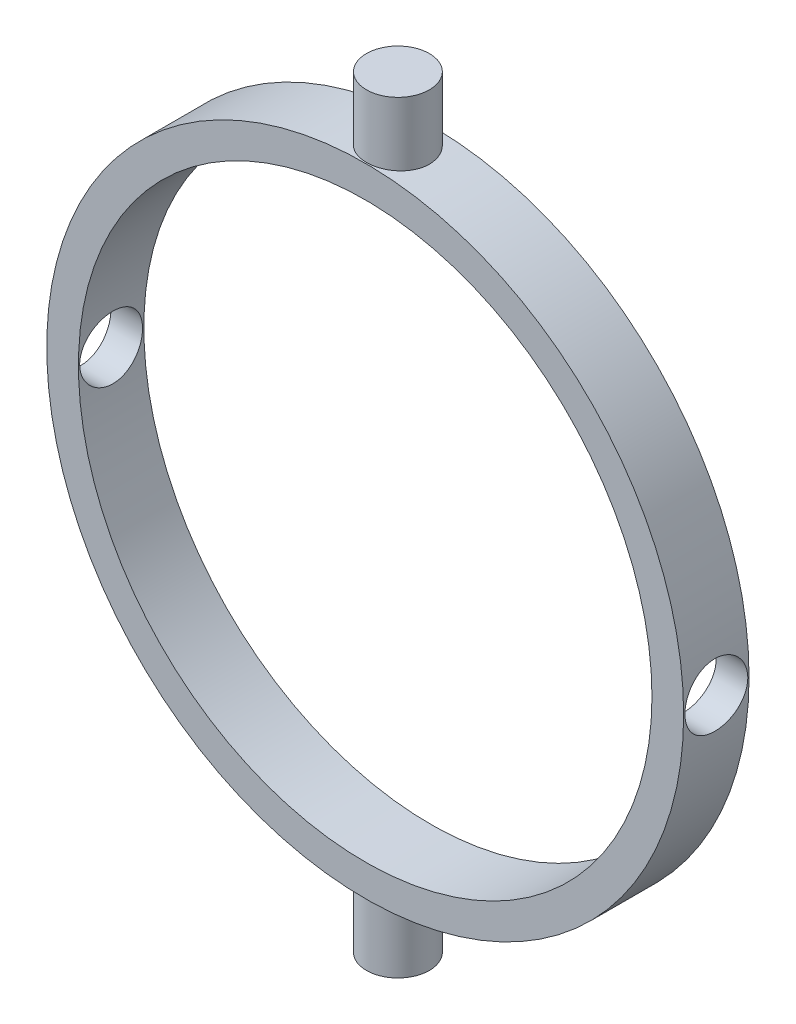
ISO-10303-21;
HEADER;
FILE_DESCRIPTION(('STEP AP214'),'2;1');
FILE_NAME('part.step','',(''),(''),'','','');
FILE_SCHEMA(('AUTOMOTIVE_DESIGN { 1 0 10303 214 1 1 1 1 }'));
ENDSEC;
DATA;
#1=APPLICATION_CONTEXT('core data for automotive mechanical design processes');
#2=APPLICATION_PROTOCOL_DEFINITION('international standard','automotive_design',2000,#1);
#3=PRODUCT_CONTEXT('',#1,'mechanical');
#4=PRODUCT('Part','Part','',(#3));
#5=PRODUCT_RELATED_PRODUCT_CATEGORY('part','',(#4));
#6=PRODUCT_DEFINITION_FORMATION('','',#4);
#7=PRODUCT_DEFINITION_CONTEXT('part definition',#1,'design');
#8=PRODUCT_DEFINITION('design','',#6,#7);
#9=PRODUCT_DEFINITION_SHAPE('','',#8);
#10=(LENGTH_UNIT() NAMED_UNIT(*) SI_UNIT(.MILLI.,.METRE.));
#11=(NAMED_UNIT(*) PLANE_ANGLE_UNIT() SI_UNIT($,.RADIAN.));
#12=(NAMED_UNIT(*) SI_UNIT($,.STERADIAN.) SOLID_ANGLE_UNIT());
#13=UNCERTAINTY_MEASURE_WITH_UNIT(LENGTH_MEASURE(1.E-05),#10,'distance_accuracy_value','');
#14=(GEOMETRIC_REPRESENTATION_CONTEXT(3) GLOBAL_UNCERTAINTY_ASSIGNED_CONTEXT((#13)) GLOBAL_UNIT_ASSIGNED_CONTEXT((#10,
#11,#12)) REPRESENTATION_CONTEXT('',''));
#15=CARTESIAN_POINT('',(0.,0.,0.));
#16=DIRECTION('',(0.,0.,1.));
#17=DIRECTION('',(1.,0.,0.));
#18=AXIS2_PLACEMENT_3D('',#15,#16,#17);
#19=CARTESIAN_POINT('',(0.,0.,3.302));
#20=DIRECTION('',(0.,0.,1.));
#21=DIRECTION('',(1.,0.,0.));
#22=AXIS2_PLACEMENT_3D('',#19,#20,#21);
#23=PLANE('',#22);
#24=CARTESIAN_POINT('',(0.,0.,3.302));
#25=DIRECTION('',(0.,0.,1.));
#26=DIRECTION('',(1.,0.,0.));
#27=AXIS2_PLACEMENT_3D('',#24,#25,#26);
#28=CIRCLE('',#27,16.078);
#29=CARTESIAN_POINT('',(16.078,0.,3.302));
#30=VERTEX_POINT('',#29);
#31=EDGE_CURVE('E10',#30,#30,#28,.T.);
#32=ORIENTED_EDGE('',*,*,#31,.T.);
#33=EDGE_LOOP('',(#32));
#34=FACE_BOUND('',#33,.T.);
#35=CARTESIAN_POINT('',(0.,0.,3.302));
#36=DIRECTION('',(0.,0.,1.));
#37=DIRECTION('',(1.,0.,0.));
#38=AXIS2_PLACEMENT_3D('',#35,#36,#37);
#39=CIRCLE('',#38,14.478);
#40=CARTESIAN_POINT('',(14.478,0.,3.302));
#41=VERTEX_POINT('',#40);
#42=EDGE_CURVE('E48',#41,#41,#39,.T.);
#43=ORIENTED_EDGE('',*,*,#42,.F.);
#44=EDGE_LOOP('',(#43));
#45=FACE_BOUND('',#44,.T.);
#46=ADVANCED_FACE('F31',(#34,#45),#23,.T.);
#47=CARTESIAN_POINT('',(0.,0.,0.));
#48=DIRECTION('',(0.,0.,1.));
#49=DIRECTION('',(1.,0.,0.));
#50=AXIS2_PLACEMENT_3D('',#47,#48,#49);
#51=PLANE('',#50);
#52=CARTESIAN_POINT('',(0.,0.,0.));
#53=DIRECTION('',(0.,0.,1.));
#54=DIRECTION('',(1.,0.,0.));
#55=AXIS2_PLACEMENT_3D('',#52,#53,#54);
#56=CIRCLE('',#55,16.078);
#57=CARTESIAN_POINT('',(16.078,0.,0.));
#58=VERTEX_POINT('',#57);
#59=EDGE_CURVE('E43',#58,#58,#56,.T.);
#60=ORIENTED_EDGE('',*,*,#59,.F.);
#61=EDGE_LOOP('',(#60));
#62=FACE_BOUND('',#61,.T.);
#63=CARTESIAN_POINT('',(0.,0.,0.));
#64=DIRECTION('',(0.,0.,1.));
#65=DIRECTION('',(1.,0.,0.));
#66=AXIS2_PLACEMENT_3D('',#63,#64,#65);
#67=CIRCLE('',#66,14.478);
#68=CARTESIAN_POINT('',(14.478,0.,0.));
#69=VERTEX_POINT('',#68);
#70=EDGE_CURVE('E51',#69,#69,#67,.T.);
#71=ORIENTED_EDGE('',*,*,#70,.T.);
#72=EDGE_LOOP('',(#71));
#73=FACE_BOUND('',#72,.T.);
#74=ADVANCED_FACE('F99',(#62,#73),#51,.F.);
#75=CARTESIAN_POINT('',(0.,0.,3.302));
#76=DIRECTION('',(0.,0.,-1.));
#77=DIRECTION('',(-1.,0.,0.));
#78=AXIS2_PLACEMENT_3D('',#75,#76,#77);
#79=CYLINDRICAL_SURFACE('',#78,16.078);
#80=CARTESIAN_POINT('',(0.,-16.078,0.0635000000000004));
#81=CARTESIAN_POINT('',(-0.0889382676750473,-16.0779989879593,0.0635038542711527));
#82=CARTESIAN_POINT('',(-0.177935479899864,-16.077254190012,0.070999191950062));
#83=CARTESIAN_POINT('',(-0.353462963078393,-16.0743546615422,0.100786642436206));
#84=CARTESIAN_POINT('',(-0.439990399665971,-16.0721983740973,0.123095095019822));
#85=CARTESIAN_POINT('',(-0.608011075362086,-16.066719294506,0.181853368071917));
#86=CARTESIAN_POINT('',(-0.689507305127902,-16.0633972033442,0.218294691985423));
#87=CARTESIAN_POINT('',(-0.845208502832662,-16.0559580732716,0.30426788499456));
#88=CARTESIAN_POINT('',(-0.919414925570739,-16.051841193462,0.353797134872641));
#89=CARTESIAN_POINT('',(-1.05870864188994,-16.0432575484305,0.464727029545062));
#90=CARTESIAN_POINT('',(-1.12376674041012,-16.0387897309302,0.526164256320707));
#91=CARTESIAN_POINT('',(-1.24266615527061,-16.0300164732231,0.659088155922096));
#92=CARTESIAN_POINT('',(-1.29650695498905,-16.0257110405024,0.730575291350765));
#93=CARTESIAN_POINT('',(-1.3915464631122,-16.0177392242088,0.881752002545344));
#94=CARTESIAN_POINT('',(-1.43271881326449,-16.014074179793,0.961458225493041));
#95=CARTESIAN_POINT('',(-1.50108437820784,-16.0078110683199,1.12669506518588));
#96=CARTESIAN_POINT('',(-1.52827793024595,-16.005212975522,1.21222554136097));
#97=CARTESIAN_POINT('',(-1.56782757151222,-16.0013873859481,1.38638565569388));
#98=CARTESIAN_POINT('',(-1.58023201433572,-16.0001554234819,1.47500421360364));
#99=CARTESIAN_POINT('',(-1.59000078289009,-15.9991876951945,1.65307335709822));
#100=CARTESIAN_POINT('',(-1.58736549463514,-15.9994518909724,1.7425239212697));
#101=CARTESIAN_POINT('',(-1.56716947066429,-16.0014425523564,1.91938474667379));
#102=CARTESIAN_POINT('',(-1.54966151054823,-16.0031638473778,2.00680110081273));
#103=CARTESIAN_POINT('',(-1.50029923682016,-16.0078666804143,2.17744854612422));
#104=CARTESIAN_POINT('',(-1.4684447337869,-16.0108482350688,2.26067958202075));
#105=CARTESIAN_POINT('',(-1.39123528411931,-16.0177415898581,2.42076060145031));
#106=CARTESIAN_POINT('',(-1.34585690114137,-16.0216550024795,2.49759920902935));
#107=CARTESIAN_POINT('',(-1.24290466275163,-16.0299697546477,2.64258972721676));
#108=CARTESIAN_POINT('',(-1.18533045940598,-16.0343711081132,2.71074138990692));
#109=CARTESIAN_POINT('',(-1.05932603440417,-16.043188855458,2.83673013479299));
#110=CARTESIAN_POINT('',(-0.990850230648413,-16.0476052327054,2.89452164018275));
#111=CARTESIAN_POINT('',(-0.845144722280787,-16.0559375396488,2.99779639681944));
#112=CARTESIAN_POINT('',(-0.767915008224165,-16.0598534688049,3.04327963478658));
#113=CARTESIAN_POINT('',(-0.606862530341768,-16.0667448994797,3.12064484352772));
#114=CARTESIAN_POINT('',(-0.523038660065916,-16.0697202427529,3.15252452593695));
#115=CARTESIAN_POINT('',(-0.351192104996481,-16.0743936285418,3.20174439561136));
#116=CARTESIAN_POINT('',(-0.263169542686512,-16.0760917082935,3.21908500673434));
#117=CARTESIAN_POINT('',(-0.0858189677551975,-16.078014455167,3.23867673307555));
#118=CARTESIAN_POINT('',(0.00350203282572145,-16.078245263841,3.24099074595732));
#119=CARTESIAN_POINT('',(0.181260596450081,-16.0772239252541,3.23062875341915));
#120=CARTESIAN_POINT('',(0.26969817110869,-16.0759717975166,3.2179529453457));
#121=CARTESIAN_POINT('',(0.442998104127631,-16.0721292355268,3.17802330697083));
#122=CARTESIAN_POINT('',(0.527867307381731,-16.0695415030083,3.15079890243897));
#123=CARTESIAN_POINT('',(0.691834079743259,-16.0633180729494,3.08257509728624));
#124=CARTESIAN_POINT('',(0.770931522483446,-16.059682352473,3.04157539517834));
#125=CARTESIAN_POINT('',(0.921394019751391,-16.0517544010219,2.94680866962908));
#126=CARTESIAN_POINT('',(0.992732915892643,-16.0474600600101,2.89300029349199));
#127=CARTESIAN_POINT('',(1.12538854300176,-16.0387035855597,2.77420297163953));
#128=CARTESIAN_POINT('',(1.18670502876311,-16.0342414480193,2.70921375245544));
#129=CARTESIAN_POINT('',(1.29779345703795,-16.0256338383346,2.56962523165333));
#130=CARTESIAN_POINT('',(1.34752413902179,-16.021489532188,2.49499301173576));
#131=CARTESIAN_POINT('',(1.43374570402312,-16.0140044404204,2.33839951148539));
#132=CARTESIAN_POINT('',(1.47023676415588,-16.0106636440505,2.25643832921529));
#133=CARTESIAN_POINT('',(1.52887406523071,-16.0051710352831,2.08765536016073));
#134=CARTESIAN_POINT('',(1.55104491423902,-16.0030171841614,2.00084219161777));
#135=CARTESIAN_POINT('',(1.58049231028194,-16.0001359515238,1.82470304183133));
#136=CARTESIAN_POINT('',(1.58776927281305,-15.9994085302147,1.7353771307566));
#137=CARTESIAN_POINT('',(1.58721664296104,-15.9994633317582,1.55715822918347));
#138=CARTESIAN_POINT('',(1.57945186671098,-16.0002390773407,1.46826502859551));
#139=CARTESIAN_POINT('',(1.54917201218494,-16.0031989979117,1.29305241721677));
#140=CARTESIAN_POINT('',(1.52665691677053,-16.0053831745367,1.20673300941661));
#141=CARTESIAN_POINT('',(1.46753331037538,-16.0109120653144,1.03911838186023));
#142=CARTESIAN_POINT('',(1.43092664256717,-16.0142566276835,0.95782250664102));
#143=CARTESIAN_POINT('',(1.34466574748404,-16.0217297454046,0.802518684060499));
#144=CARTESIAN_POINT('',(1.29501160400609,-16.0258582957214,0.728510689897217));
#145=CARTESIAN_POINT('',(1.18382180137763,-16.0344555038849,0.589551285554547));
#146=CARTESIAN_POINT('',(1.12223786153087,-16.0389254974754,0.524638589440587));
#147=CARTESIAN_POINT('',(0.989031649090707,-16.0476897345662,0.406039826833557));
#148=CARTESIAN_POINT('',(0.917406973596753,-16.0519839356779,0.352356455375063));
#149=CARTESIAN_POINT('',(0.765960199905421,-16.0599236839797,0.257636854017595));
#150=CARTESIAN_POINT('',(0.68611834471779,-16.063567607379,0.216632101732114));
#151=CARTESIAN_POINT('',(0.520697890948837,-16.0697784779415,0.148665733787644));
#152=CARTESIAN_POINT('',(0.435125894942022,-16.0723466407046,0.121688259062102));
#153=CARTESIAN_POINT('',(0.290889823293342,-16.0754701825916,0.0892809098448161));
#154=CARTESIAN_POINT('',(0.233148239987445,-16.0764144489045,0.0796262486395796));
#155=CARTESIAN_POINT('',(0.116946265843121,-16.0776796891228,0.0667345392533737));
#156=CARTESIAN_POINT('',(0.0584858778779333,-16.0780006655188,0.0634974654281247));
#157=CARTESIAN_POINT('',(0.,-16.078,0.0635000000000004));
#158=B_SPLINE_CURVE_WITH_KNOTS('',3,(#80,#81,#82,#83,#84,#85,#86,#87,#88,#89,#90,#91,#92,#93,
#94,#95,#96,#97,#98,#99,#100,#101,#102,#103,#104,#105,#106,#107,#108,#109,#110,#111,#112,#113,
#114,#115,#116,#117,#118,#119,#120,#121,#122,#123,#124,#125,#126,#127,#128,#129,#130,#131,#132,
#133,#134,#135,#136,#137,#138,#139,#140,#141,#142,#143,#144,#145,#146,#147,#148,#149,#150,#151,
#152,#153,#154,#155,#156,#157),.UNSPECIFIED.,.T.,.F.,(4,2,2,2,2,2,2,2,2,2,2,2,2,2,2,2,2,2,2,2,2,
2,2,2,2,2,2,2,2,2,2,2,2,2,2,2,2,2,4),(0.,0.266601237000976,0.533497041165417,0.800232638087441,
1.06691489499633,1.33442978562871,1.60195699415573,1.87003711935707,2.13811077665789,
2.40530553133801,2.67249342814915,2.93873715166086,3.20498439056273,3.47169573510877,
3.73841468967208,4.0062796545225,4.27414490838012,4.54205520428524,4.80995768952527,
5.07673807371216,5.3435149456765,5.60975426975455,5.87599942114301,6.1431160879912,
6.41023928909071,6.67829973030864,6.94635658537067,7.2139515732903,7.48153909597926,
7.74797612575933,8.01441346511361,8.28081596639593,8.54721675675906,8.81471910571989,
9.08228558169042,9.35051111618043,9.61843273517916,9.79375062818084,9.96906782062172),.UNSPECIFIED.);
#159=CARTESIAN_POINT('',(0.,-16.078,0.0635000000000004));
#160=VERTEX_POINT('',#159);
#161=EDGE_CURVE('E36',#160,#160,#158,.T.);
#162=ORIENTED_EDGE('',*,*,#161,.T.);
#163=EDGE_LOOP('',(#162));
#164=FACE_BOUND('',#163,.T.);
#165=CARTESIAN_POINT('',(0.,16.078,3.2385));
#166=CARTESIAN_POINT('',(-0.0889382676750473,16.0779989879593,3.23849614572885));
#167=CARTESIAN_POINT('',(-0.177935479899864,16.077254190012,3.23100080804994));
#168=CARTESIAN_POINT('',(-0.353462963078393,16.0743546615422,3.20121335756379));
#169=CARTESIAN_POINT('',(-0.439990399665971,16.0721983740973,3.17890490498018));
#170=CARTESIAN_POINT('',(-0.608011075362086,16.066719294506,3.12014663192808));
#171=CARTESIAN_POINT('',(-0.689507305127902,16.0633972033442,3.08370530801458));
#172=CARTESIAN_POINT('',(-0.845208502832662,16.0559580732716,2.99773211500544));
#173=CARTESIAN_POINT('',(-0.919414925570739,16.051841193462,2.94820286512736));
#174=CARTESIAN_POINT('',(-1.05870864188994,16.0432575484305,2.83727297045494));
#175=CARTESIAN_POINT('',(-1.12376674041012,16.0387897309302,2.77583574367929));
#176=CARTESIAN_POINT('',(-1.24266615527061,16.0300164732231,2.6429118440779));
#177=CARTESIAN_POINT('',(-1.29650695498905,16.0257110405024,2.57142470864924));
#178=CARTESIAN_POINT('',(-1.3915464631122,16.0177392242088,2.42024799745466));
#179=CARTESIAN_POINT('',(-1.43271881326449,16.014074179793,2.34054177450696));
#180=CARTESIAN_POINT('',(-1.50108437820784,16.0078110683199,2.17530493481412));
#181=CARTESIAN_POINT('',(-1.52827793024595,16.005212975522,2.08977445863903));
#182=CARTESIAN_POINT('',(-1.56782757151222,16.0013873859481,1.91561434430612));
#183=CARTESIAN_POINT('',(-1.58023201433572,16.0001554234819,1.82699578639636));
#184=CARTESIAN_POINT('',(-1.59000078289009,15.9991876951945,1.64892664290178));
#185=CARTESIAN_POINT('',(-1.58736549463514,15.9994518909724,1.5594760787303));
#186=CARTESIAN_POINT('',(-1.56716947066429,16.0014425523564,1.38261525332621));
#187=CARTESIAN_POINT('',(-1.54966151054823,16.0031638473778,1.29519889918727));
#188=CARTESIAN_POINT('',(-1.50029923682016,16.0078666804143,1.12455145387578));
#189=CARTESIAN_POINT('',(-1.4684447337869,16.0108482350688,1.04132041797925));
#190=CARTESIAN_POINT('',(-1.39123528411931,16.0177415898581,0.881239398549692));
#191=CARTESIAN_POINT('',(-1.34585690114137,16.0216550024795,0.804400790970648));
#192=CARTESIAN_POINT('',(-1.24290466275163,16.0299697546477,0.659410272783238));
#193=CARTESIAN_POINT('',(-1.18533045940599,16.0343711081132,0.591258610093078));
#194=CARTESIAN_POINT('',(-1.05932603440417,16.043188855458,0.465269865207013));
#195=CARTESIAN_POINT('',(-0.990850230648413,16.0476052327054,0.407478359817253));
#196=CARTESIAN_POINT('',(-0.845144722280787,16.0559375396488,0.304203603180557));
#197=CARTESIAN_POINT('',(-0.767915008224166,16.0598534688049,0.258720365213418));
#198=CARTESIAN_POINT('',(-0.606862530341768,16.0667448994797,0.181355156472282));
#199=CARTESIAN_POINT('',(-0.523038660065917,16.0697202427529,0.149475474063051));
#200=CARTESIAN_POINT('',(-0.351192104996482,16.0743936285418,0.10025560438864));
#201=CARTESIAN_POINT('',(-0.263169542686513,16.0760917082935,0.0829149932656627));
#202=CARTESIAN_POINT('',(-0.0858189677551977,16.078014455167,0.0633232669244469));
#203=CARTESIAN_POINT('',(0.00350203282572094,16.078245263841,0.0610092540426821));
#204=CARTESIAN_POINT('',(0.18126059645008,16.0772239252541,0.0713712465808547));
#205=CARTESIAN_POINT('',(0.26969817110869,16.0759717975166,0.0840470546542993));
#206=CARTESIAN_POINT('',(0.442998104127631,16.0721292355268,0.123976693029168));
#207=CARTESIAN_POINT('',(0.527867307381731,16.0695415030083,0.151201097561031));
#208=CARTESIAN_POINT('',(0.691834079743259,16.0633180729494,0.219424902713759));
#209=CARTESIAN_POINT('',(0.770931522483446,16.059682352473,0.260424604821665));
#210=CARTESIAN_POINT('',(0.921394019751391,16.0517544010219,0.355191330370922));
#211=CARTESIAN_POINT('',(0.992732915892643,16.0474600600101,0.40899970650801));
#212=CARTESIAN_POINT('',(1.12538854300176,16.0387035855597,0.527797028360472));
#213=CARTESIAN_POINT('',(1.18670502876311,16.0342414480193,0.592786247544556));
#214=CARTESIAN_POINT('',(1.29779345703795,16.0256338383346,0.73237476834667));
#215=CARTESIAN_POINT('',(1.34752413902179,16.021489532188,0.807006988264242));
#216=CARTESIAN_POINT('',(1.43374570402312,16.0140044404204,0.963600488514615));
#217=CARTESIAN_POINT('',(1.47023676415588,16.0106636440505,1.0455616707847));
#218=CARTESIAN_POINT('',(1.52887406523071,16.0051710352831,1.21434463983927));
#219=CARTESIAN_POINT('',(1.55104491423902,16.0030171841614,1.30115780838223));
#220=CARTESIAN_POINT('',(1.58049231028194,16.0001359515238,1.47729695816867));
#221=CARTESIAN_POINT('',(1.58776927281305,15.9994085302147,1.5666228692434));
#222=CARTESIAN_POINT('',(1.58721664296104,15.9994633317582,1.74484177081653));
#223=CARTESIAN_POINT('',(1.57945186671098,16.0002390773407,1.83373497140449));
#224=CARTESIAN_POINT('',(1.54917201218494,16.0031989979117,2.00894758278323));
#225=CARTESIAN_POINT('',(1.52665691677053,16.0053831745367,2.09526699058339));
#226=CARTESIAN_POINT('',(1.46753331037538,16.0109120653144,2.26288161813977));
#227=CARTESIAN_POINT('',(1.43092664256717,16.0142566276835,2.34417749335898));
#228=CARTESIAN_POINT('',(1.34466574748404,16.0217297454046,2.4994813159395));
#229=CARTESIAN_POINT('',(1.29501160400609,16.0258582957214,2.57348931010278));
#230=CARTESIAN_POINT('',(1.18382180137763,16.0344555038849,2.71244871444545));
#231=CARTESIAN_POINT('',(1.12223786153087,16.0389254974754,2.77736141055941));
#232=CARTESIAN_POINT('',(0.989031649090709,16.0476897345662,2.89596017316644));
#233=CARTESIAN_POINT('',(0.917406973596754,16.0519839356779,2.94964354462494));
#234=CARTESIAN_POINT('',(0.765960199905421,16.0599236839797,3.0443631459824));
#235=CARTESIAN_POINT('',(0.68611834471779,16.063567607379,3.08536789826789));
#236=CARTESIAN_POINT('',(0.520697890948838,16.0697784779415,3.15333426621236));
#237=CARTESIAN_POINT('',(0.435125894942022,16.0723466407046,3.1803117409379));
#238=CARTESIAN_POINT('',(0.290889823293343,16.0754701825916,3.21271909015518));
#239=CARTESIAN_POINT('',(0.233148239987445,16.0764144489045,3.22237375136042));
#240=CARTESIAN_POINT('',(0.116946265843121,16.0776796891228,3.23526546074663));
#241=CARTESIAN_POINT('',(0.0584858778779333,16.0780006655188,3.23850253457188));
#242=CARTESIAN_POINT('',(0.,16.078,3.2385));
#243=B_SPLINE_CURVE_WITH_KNOTS('',3,(#165,#166,#167,#168,#169,#170,#171,#172,#173,#174,#175,
#176,#177,#178,#179,#180,#181,#182,#183,#184,#185,#186,#187,#188,#189,#190,#191,#192,#193,#194,
#195,#196,#197,#198,#199,#200,#201,#202,#203,#204,#205,#206,#207,#208,#209,#210,#211,#212,#213,
#214,#215,#216,#217,#218,#219,#220,#221,#222,#223,#224,#225,#226,#227,#228,#229,#230,#231,#232,
#233,#234,#235,#236,#237,#238,#239,#240,#241,#242),.UNSPECIFIED.,.T.,.F.,(4,2,2,2,2,2,2,2,2,2,2,
2,2,2,2,2,2,2,2,2,2,2,2,2,2,2,2,2,2,2,2,2,2,2,2,2,2,2,4),(0.,0.266601237000976,
0.533497041165416,0.800232638087441,1.06691489499633,1.33442978562871,1.60195699415572,
1.87003711935707,2.13811077665789,2.40530553133801,2.67249342814914,2.93873715166086,
3.20498439056273,3.47169573510877,3.73841468967207,4.0062796545225,4.27414490838012,
4.54205520428524,4.80995768952527,5.07673807371216,5.3435149456765,5.60975426975455,
5.87599942114301,6.1431160879912,6.41023928909071,6.67829973030863,6.94635658537067,
7.21395157329029,7.48153909597925,7.74797612575933,8.0144134651136,8.28081596639593,
8.54721675675905,8.81471910571988,9.08228558169042,9.35051111618043,9.61843273517916,
9.79375062818084,9.96906782062172),.UNSPECIFIED.);
#244=CARTESIAN_POINT('',(0.,16.078,3.2385));
#245=VERTEX_POINT('',#244);
#246=EDGE_CURVE('E62',#245,#245,#243,.T.);
#247=ORIENTED_EDGE('',*,*,#246,.T.);
#248=EDGE_LOOP('',(#247));
#249=FACE_BOUND('',#248,.T.);
#250=CARTESIAN_POINT('',(-16.078,0.,0.0634999999999995));
#251=CARTESIAN_POINT('',(-16.0779989879593,0.0889382676750473,0.0635038542711518));
#252=CARTESIAN_POINT('',(-16.077254190012,0.177935479899864,0.0709991919500611));
#253=CARTESIAN_POINT('',(-16.0743546615422,0.353462963078393,0.100786642436205));
#254=CARTESIAN_POINT('',(-16.0721983740973,0.439990399665971,0.123095095019821));
#255=CARTESIAN_POINT('',(-16.066719294506,0.608011075362086,0.181853368071917));
#256=CARTESIAN_POINT('',(-16.0633972033442,0.689507305127902,0.218294691985423));
#257=CARTESIAN_POINT('',(-16.0559580732716,0.845208502832662,0.304267884994559));
#258=CARTESIAN_POINT('',(-16.051841193462,0.919414925570739,0.35379713487264));
#259=CARTESIAN_POINT('',(-16.0432575484305,1.05870864188994,0.464727029545061));
#260=CARTESIAN_POINT('',(-16.0387897309302,1.12376674041012,0.526164256320707));
#261=CARTESIAN_POINT('',(-16.0300164732231,1.24266615527061,0.659088155922095));
#262=CARTESIAN_POINT('',(-16.0257110405024,1.29650695498905,0.730575291350764));
#263=CARTESIAN_POINT('',(-16.0177392242088,1.3915464631122,0.881752002545343));
#264=CARTESIAN_POINT('',(-16.014074179793,1.43271881326449,0.96145822549304));
#265=CARTESIAN_POINT('',(-16.0078110683199,1.50108437820784,1.12669506518588));
#266=CARTESIAN_POINT('',(-16.005212975522,1.52827793024595,1.21222554136097));
#267=CARTESIAN_POINT('',(-16.0013873859481,1.56782757151222,1.38638565569388));
#268=CARTESIAN_POINT('',(-16.0001554234819,1.58023201433572,1.47500421360364));
#269=CARTESIAN_POINT('',(-15.9991876951945,1.59000078289009,1.65307335709822));
#270=CARTESIAN_POINT('',(-15.9994518909724,1.58736549463514,1.7425239212697));
#271=CARTESIAN_POINT('',(-16.0014425523564,1.56716947066429,1.91938474667379));
#272=CARTESIAN_POINT('',(-16.0031638473778,1.54966151054823,2.00680110081273));
#273=CARTESIAN_POINT('',(-16.0078666804143,1.50029923682016,2.17744854612422));
#274=CARTESIAN_POINT('',(-16.0108482350688,1.4684447337869,2.26067958202075));
#275=CARTESIAN_POINT('',(-16.0177415898581,1.39123528411931,2.42076060145031));
#276=CARTESIAN_POINT('',(-16.0216550024795,1.34585690114137,2.49759920902935));
#277=CARTESIAN_POINT('',(-16.0299697546477,1.24290466275163,2.64258972721676));
#278=CARTESIAN_POINT('',(-16.0343711081132,1.18533045940598,2.71074138990692));
#279=CARTESIAN_POINT('',(-16.043188855458,1.05932603440417,2.83673013479299));
#280=CARTESIAN_POINT('',(-16.0476052327054,0.990850230648413,2.89452164018275));
#281=CARTESIAN_POINT('',(-16.0559375396488,0.845144722280787,2.99779639681944));
#282=CARTESIAN_POINT('',(-16.0598534688049,0.767915008224165,3.04327963478658));
#283=CARTESIAN_POINT('',(-16.0667448994797,0.606862530341768,3.12064484352772));
#284=CARTESIAN_POINT('',(-16.0697202427529,0.523038660065916,3.15252452593695));
#285=CARTESIAN_POINT('',(-16.0743936285418,0.351192104996481,3.20174439561136));
#286=CARTESIAN_POINT('',(-16.0760917082935,0.263169542686512,3.21908500673434));
#287=CARTESIAN_POINT('',(-16.078014455167,0.0858189677551975,3.23867673307555));
#288=CARTESIAN_POINT('',(-16.078245263841,-0.00350203282572145,3.24099074595732));
#289=CARTESIAN_POINT('',(-16.0772239252541,-0.181260596450081,3.23062875341915));
#290=CARTESIAN_POINT('',(-16.0759717975166,-0.26969817110869,3.2179529453457));
#291=CARTESIAN_POINT('',(-16.0721292355268,-0.442998104127631,3.17802330697083));
#292=CARTESIAN_POINT('',(-16.0695415030083,-0.527867307381731,3.15079890243897));
#293=CARTESIAN_POINT('',(-16.0633180729494,-0.691834079743259,3.08257509728624));
#294=CARTESIAN_POINT('',(-16.059682352473,-0.770931522483446,3.04157539517833));
#295=CARTESIAN_POINT('',(-16.0517544010219,-0.921394019751391,2.94680866962908));
#296=CARTESIAN_POINT('',(-16.0474600600101,-0.992732915892643,2.89300029349199));
#297=CARTESIAN_POINT('',(-16.0387035855597,-1.12538854300176,2.77420297163953));
#298=CARTESIAN_POINT('',(-16.0342414480193,-1.18670502876311,2.70921375245544));
#299=CARTESIAN_POINT('',(-16.0256338383346,-1.29779345703795,2.56962523165333));
#300=CARTESIAN_POINT('',(-16.021489532188,-1.34752413902179,2.49499301173576));
#301=CARTESIAN_POINT('',(-16.0140044404204,-1.43374570402312,2.33839951148538));
#302=CARTESIAN_POINT('',(-16.0106636440505,-1.47023676415588,2.25643832921529));
#303=CARTESIAN_POINT('',(-16.0051710352831,-1.52887406523071,2.08765536016072));
#304=CARTESIAN_POINT('',(-16.0030171841614,-1.55104491423902,2.00084219161777));
#305=CARTESIAN_POINT('',(-16.0001359515238,-1.58049231028194,1.82470304183133));
#306=CARTESIAN_POINT('',(-15.9994085302147,-1.58776927281305,1.7353771307566));
#307=CARTESIAN_POINT('',(-15.9994633317582,-1.58721664296104,1.55715822918347));
#308=CARTESIAN_POINT('',(-16.0002390773407,-1.57945186671098,1.46826502859551));
#309=CARTESIAN_POINT('',(-16.0031989979117,-1.54917201218494,1.29305241721677));
#310=CARTESIAN_POINT('',(-16.0053831745367,-1.52665691677053,1.2067330094166));
#311=CARTESIAN_POINT('',(-16.0109120653144,-1.46753331037538,1.03911838186023));
#312=CARTESIAN_POINT('',(-16.0142566276835,-1.43092664256717,0.957822506641019));
#313=CARTESIAN_POINT('',(-16.0217297454046,-1.34466574748404,0.802518684060498));
#314=CARTESIAN_POINT('',(-16.0258582957214,-1.29501160400609,0.728510689897216));
#315=CARTESIAN_POINT('',(-16.0344555038849,-1.18382180137763,0.589551285554546));
#316=CARTESIAN_POINT('',(-16.0389254974754,-1.12223786153087,0.524638589440586));
#317=CARTESIAN_POINT('',(-16.0476897345662,-0.989031649090707,0.406039826833556));
#318=CARTESIAN_POINT('',(-16.0519839356779,-0.917406973596753,0.352356455375062));
#319=CARTESIAN_POINT('',(-16.0599236839797,-0.765960199905421,0.257636854017595));
#320=CARTESIAN_POINT('',(-16.063567607379,-0.68611834471779,0.216632101732113));
#321=CARTESIAN_POINT('',(-16.0697784779415,-0.520697890948837,0.148665733787643));
#322=CARTESIAN_POINT('',(-16.0723466407046,-0.435125894942022,0.121688259062101));
#323=CARTESIAN_POINT('',(-16.0754701825916,-0.290889823293342,0.0892809098448153));
#324=CARTESIAN_POINT('',(-16.0764144489045,-0.233148239987445,0.0796262486395787));
#325=CARTESIAN_POINT('',(-16.0776796891228,-0.116946265843121,0.0667345392533728));
#326=CARTESIAN_POINT('',(-16.0780006655188,-0.0584858778779333,0.0634974654281238));
#327=CARTESIAN_POINT('',(-16.078,0.,0.0634999999999995));
#328=B_SPLINE_CURVE_WITH_KNOTS('',3,(#250,#251,#252,#253,#254,#255,#256,#257,#258,#259,#260,
#261,#262,#263,#264,#265,#266,#267,#268,#269,#270,#271,#272,#273,#274,#275,#276,#277,#278,#279,
#280,#281,#282,#283,#284,#285,#286,#287,#288,#289,#290,#291,#292,#293,#294,#295,#296,#297,#298,
#299,#300,#301,#302,#303,#304,#305,#306,#307,#308,#309,#310,#311,#312,#313,#314,#315,#316,#317,
#318,#319,#320,#321,#322,#323,#324,#325,#326,#327),.UNSPECIFIED.,.T.,.F.,(4,2,2,2,2,2,2,2,2,2,2,
2,2,2,2,2,2,2,2,2,2,2,2,2,2,2,2,2,2,2,2,2,2,2,2,2,2,2,4),(0.,0.266601237000976,
0.533497041165417,0.800232638087441,1.06691489499633,1.33442978562871,1.60195699415573,
1.87003711935707,2.13811077665789,2.40530553133801,2.67249342814915,2.93873715166086,
3.20498439056273,3.47169573510877,3.73841468967208,4.0062796545225,4.27414490838012,
4.54205520428524,4.80995768952527,5.07673807371216,5.3435149456765,5.60975426975455,
5.87599942114301,6.1431160879912,6.41023928909071,6.67829973030864,6.94635658537067,
7.2139515732903,7.48153909597926,7.74797612575933,8.01441346511361,8.28081596639593,
8.54721675675906,8.81471910571989,9.08228558169042,9.35051111618043,9.61843273517916,
9.79375062818084,9.96906782062172),.UNSPECIFIED.);
#329=CARTESIAN_POINT('',(-16.078,0.,0.0634999999999995));
#330=VERTEX_POINT('',#329);
#331=EDGE_CURVE('E87',#330,#330,#328,.T.);
#332=ORIENTED_EDGE('',*,*,#331,.T.);
#333=EDGE_LOOP('',(#332));
#334=FACE_BOUND('',#333,.T.);
#335=CARTESIAN_POINT('',(16.078,0.,0.0634999999999998));
#336=CARTESIAN_POINT('',(16.0779989879593,-0.0889382676750473,0.0635038542711522));
#337=CARTESIAN_POINT('',(16.077254190012,-0.177935479899864,0.0709991919500613));
#338=CARTESIAN_POINT('',(16.0743546615422,-0.353462963078393,0.100786642436205));
#339=CARTESIAN_POINT('',(16.0721983740973,-0.439990399665971,0.123095095019821));
#340=CARTESIAN_POINT('',(16.066719294506,-0.608011075362086,0.181853368071916));
#341=CARTESIAN_POINT('',(16.0633972033442,-0.689507305127902,0.218294691985422));
#342=CARTESIAN_POINT('',(16.0559580732716,-0.845208502832662,0.304267884994559));
#343=CARTESIAN_POINT('',(16.051841193462,-0.919414925570739,0.35379713487264));
#344=CARTESIAN_POINT('',(16.0432575484305,-1.05870864188994,0.464727029545061));
#345=CARTESIAN_POINT('',(16.0387897309302,-1.12376674041012,0.526164256320706));
#346=CARTESIAN_POINT('',(16.0300164732231,-1.24266615527061,0.659088155922095));
#347=CARTESIAN_POINT('',(16.0257110405024,-1.29650695498905,0.730575291350764));
#348=CARTESIAN_POINT('',(16.0177392242088,-1.3915464631122,0.881752002545343));
#349=CARTESIAN_POINT('',(16.014074179793,-1.43271881326449,0.96145822549304));
#350=CARTESIAN_POINT('',(16.0078110683199,-1.50108437820784,1.12669506518588));
#351=CARTESIAN_POINT('',(16.005212975522,-1.52827793024595,1.21222554136097));
#352=CARTESIAN_POINT('',(16.0013873859481,-1.56782757151222,1.38638565569388));
#353=CARTESIAN_POINT('',(16.0001554234819,-1.58023201433572,1.47500421360364));
#354=CARTESIAN_POINT('',(15.9991876951945,-1.59000078289009,1.65307335709822));
#355=CARTESIAN_POINT('',(15.9994518909724,-1.58736549463514,1.7425239212697));
#356=CARTESIAN_POINT('',(16.0014425523564,-1.56716947066429,1.91938474667379));
#357=CARTESIAN_POINT('',(16.0031638473778,-1.54966151054823,2.00680110081273));
#358=CARTESIAN_POINT('',(16.0078666804143,-1.50029923682016,2.17744854612422));
#359=CARTESIAN_POINT('',(16.0108482350688,-1.4684447337869,2.26067958202075));
#360=CARTESIAN_POINT('',(16.0177415898581,-1.39123528411931,2.42076060145031));
#361=CARTESIAN_POINT('',(16.0216550024795,-1.34585690114137,2.49759920902935));
#362=CARTESIAN_POINT('',(16.0299697546477,-1.24290466275163,2.64258972721676));
#363=CARTESIAN_POINT('',(16.0343711081132,-1.18533045940599,2.71074138990692));
#364=CARTESIAN_POINT('',(16.043188855458,-1.05932603440417,2.83673013479299));
#365=CARTESIAN_POINT('',(16.0476052327054,-0.990850230648413,2.89452164018275));
#366=CARTESIAN_POINT('',(16.0559375396488,-0.845144722280787,2.99779639681944));
#367=CARTESIAN_POINT('',(16.0598534688049,-0.767915008224165,3.04327963478658));
#368=CARTESIAN_POINT('',(16.0667448994797,-0.606862530341768,3.12064484352772));
#369=CARTESIAN_POINT('',(16.0697202427529,-0.523038660065917,3.15252452593695));
#370=CARTESIAN_POINT('',(16.0743936285418,-0.351192104996481,3.20174439561136));
#371=CARTESIAN_POINT('',(16.0760917082935,-0.263169542686513,3.21908500673434));
#372=CARTESIAN_POINT('',(16.078014455167,-0.0858189677551977,3.23867673307555));
#373=CARTESIAN_POINT('',(16.078245263841,0.00350203282572094,3.24099074595732));
#374=CARTESIAN_POINT('',(16.0772239252541,0.18126059645008,3.23062875341915));
#375=CARTESIAN_POINT('',(16.0759717975166,0.269698171108689,3.2179529453457));
#376=CARTESIAN_POINT('',(16.0721292355268,0.442998104127631,3.17802330697083));
#377=CARTESIAN_POINT('',(16.0695415030083,0.527867307381731,3.15079890243897));
#378=CARTESIAN_POINT('',(16.0633180729494,0.691834079743259,3.08257509728624));
#379=CARTESIAN_POINT('',(16.059682352473,0.770931522483446,3.04157539517833));
#380=CARTESIAN_POINT('',(16.0517544010219,0.921394019751391,2.94680866962908));
#381=CARTESIAN_POINT('',(16.0474600600101,0.992732915892643,2.89300029349199));
#382=CARTESIAN_POINT('',(16.0387035855597,1.12538854300176,2.77420297163953));
#383=CARTESIAN_POINT('',(16.0342414480193,1.18670502876311,2.70921375245544));
#384=CARTESIAN_POINT('',(16.0256338383346,1.29779345703795,2.56962523165333));
#385=CARTESIAN_POINT('',(16.021489532188,1.34752413902179,2.49499301173576));
#386=CARTESIAN_POINT('',(16.0140044404204,1.43374570402312,2.33839951148539));
#387=CARTESIAN_POINT('',(16.0106636440505,1.47023676415588,2.2564383292153));
#388=CARTESIAN_POINT('',(16.0051710352831,1.52887406523071,2.08765536016073));
#389=CARTESIAN_POINT('',(16.0030171841614,1.55104491423902,2.00084219161777));
#390=CARTESIAN_POINT('',(16.0001359515238,1.58049231028194,1.82470304183133));
#391=CARTESIAN_POINT('',(15.9994085302147,1.58776927281305,1.7353771307566));
#392=CARTESIAN_POINT('',(15.9994633317582,1.58721664296104,1.55715822918347));
#393=CARTESIAN_POINT('',(16.0002390773407,1.57945186671098,1.46826502859551));
#394=CARTESIAN_POINT('',(16.0031989979117,1.54917201218494,1.29305241721677));
#395=CARTESIAN_POINT('',(16.0053831745367,1.52665691677053,1.20673300941661));
#396=CARTESIAN_POINT('',(16.0109120653144,1.46753331037538,1.03911838186023));
#397=CARTESIAN_POINT('',(16.0142566276835,1.43092664256717,0.95782250664102));
#398=CARTESIAN_POINT('',(16.0217297454046,1.34466574748404,0.802518684060499));
#399=CARTESIAN_POINT('',(16.0258582957214,1.29501160400609,0.728510689897217));
#400=CARTESIAN_POINT('',(16.0344555038849,1.18382180137763,0.589551285554547));
#401=CARTESIAN_POINT('',(16.0389254974754,1.12223786153087,0.524638589440587));
#402=CARTESIAN_POINT('',(16.0476897345662,0.989031649090707,0.406039826833556));
#403=CARTESIAN_POINT('',(16.0519839356779,0.917406973596753,0.352356455375063));
#404=CARTESIAN_POINT('',(16.0599236839797,0.765960199905421,0.257636854017595));
#405=CARTESIAN_POINT('',(16.063567607379,0.68611834471779,0.216632101732113));
#406=CARTESIAN_POINT('',(16.0697784779415,0.520697890948838,0.148665733787643));
#407=CARTESIAN_POINT('',(16.0723466407046,0.435125894942023,0.121688259062101));
#408=CARTESIAN_POINT('',(16.0754701825916,0.290889823293343,0.0892809098448155));
#409=CARTESIAN_POINT('',(16.0764144489045,0.233148239987445,0.0796262486395787));
#410=CARTESIAN_POINT('',(16.0776796891228,0.116946265843122,0.0667345392533727));
#411=CARTESIAN_POINT('',(16.0780006655188,0.0584858778779334,0.063497465428124));
#412=CARTESIAN_POINT('',(16.078,0.,0.0634999999999998));
#413=B_SPLINE_CURVE_WITH_KNOTS('',3,(#335,#336,#337,#338,#339,#340,#341,#342,#343,#344,#345,
#346,#347,#348,#349,#350,#351,#352,#353,#354,#355,#356,#357,#358,#359,#360,#361,#362,#363,#364,
#365,#366,#367,#368,#369,#370,#371,#372,#373,#374,#375,#376,#377,#378,#379,#380,#381,#382,#383,
#384,#385,#386,#387,#388,#389,#390,#391,#392,#393,#394,#395,#396,#397,#398,#399,#400,#401,#402,
#403,#404,#405,#406,#407,#408,#409,#410,#411,#412),.UNSPECIFIED.,.T.,.F.,(4,2,2,2,2,2,2,2,2,2,2,
2,2,2,2,2,2,2,2,2,2,2,2,2,2,2,2,2,2,2,2,2,2,2,2,2,2,2,4),(0.,0.266601237000976,
0.533497041165416,0.800232638087441,1.06691489499633,1.33442978562871,1.60195699415573,
1.87003711935707,2.13811077665789,2.40530553133801,2.67249342814914,2.93873715166086,
3.20498439056273,3.47169573510877,3.73841468967207,4.0062796545225,4.27414490838012,
4.54205520428524,4.80995768952527,5.07673807371216,5.3435149456765,5.60975426975455,
5.87599942114301,6.1431160879912,6.41023928909071,6.67829973030863,6.94635658537067,
7.21395157329029,7.48153909597926,7.74797612575933,8.0144134651136,8.28081596639593,
8.54721675675905,8.81471910571989,9.08228558169042,9.35051111618043,9.61843273517916,
9.79375062818084,9.96906782062172),.UNSPECIFIED.);
#414=CARTESIAN_POINT('',(16.078,0.,0.0634999999999998));
#415=VERTEX_POINT('',#414);
#416=EDGE_CURVE('E82',#415,#415,#413,.T.);
#417=ORIENTED_EDGE('',*,*,#416,.T.);
#418=EDGE_LOOP('',(#417));
#419=FACE_BOUND('',#418,.T.);
#420=ORIENTED_EDGE('',*,*,#31,.F.);
#421=EDGE_LOOP('',(#420));
#422=FACE_BOUND('',#421,.T.);
#423=ORIENTED_EDGE('',*,*,#59,.T.);
#424=EDGE_LOOP('',(#423));
#425=FACE_BOUND('',#424,.T.);
#426=ADVANCED_FACE('F33',(#164,#249,#334,#419,#422,#425),#79,.T.);
#427=CARTESIAN_POINT('',(0.,0.,3.302));
#428=DIRECTION('',(0.,0.,-1.));
#429=DIRECTION('',(-1.,0.,0.));
#430=AXIS2_PLACEMENT_3D('',#427,#428,#429);
#431=CYLINDRICAL_SURFACE('',#430,14.478);
#432=CARTESIAN_POINT('',(-14.478,0.,3.2385));
#433=CARTESIAN_POINT('',(-14.4779988900269,-0.0888843367055976,3.23849617540591));
#434=CARTESIAN_POINT('',(-14.4771727941081,-0.1778262817046,3.23100988440182));
#435=CARTESIAN_POINT('',(-14.4739567783099,-0.353241066189279,3.20126047114509));
#436=CARTESIAN_POINT('',(-14.4715651679356,-0.439711130990894,3.17898137475215));
#437=CARTESIAN_POINT('',(-14.4654878982988,-0.607616822845137,3.12030559248017));
#438=CARTESIAN_POINT('',(-14.4618030530902,-0.689055579123652,3.08391778611978));
#439=CARTESIAN_POINT('',(-14.4535505498162,-0.844653003288016,2.9980755563009));
#440=CARTESIAN_POINT('',(-14.4489830586218,-0.918813043282275,2.94862360207425));
#441=CARTESIAN_POINT('',(-14.4394544075581,-1.05808272962551,2.83782970084004));
#442=CARTESIAN_POINT('',(-14.4344918112272,-1.12315674011596,2.77644307820992));
#443=CARTESIAN_POINT('',(-14.4247440348556,-1.24210062202032,2.64361797164198));
#444=CARTESIAN_POINT('',(-14.4199588633198,-1.29596995691144,2.57217900663395));
#445=CARTESIAN_POINT('',(-14.4110932988536,-1.39110415475572,2.42105065496517));
#446=CARTESIAN_POINT('',(-14.4070147458601,-1.432336320507,2.34134056844967));
#447=CARTESIAN_POINT('',(-14.4000425108557,-1.5008169687047,2.17607573143328));
#448=CARTESIAN_POINT('',(-14.3971487939834,-1.52806586258541,2.09052115298067));
#449=CARTESIAN_POINT('',(-14.3928871759953,-1.56769976485701,1.91636203634928));
#450=CARTESIAN_POINT('',(-14.3915131636102,-1.58014432210587,1.82777120196347));
#451=CARTESIAN_POINT('',(-14.3904276707771,-1.59000044145677,1.64974853506113));
#452=CARTESIAN_POINT('',(-14.3907161383258,-1.58741247378528,1.56031672893807));
#453=CARTESIAN_POINT('',(-14.3929174249435,-1.56732601331027,1.38356286435838));
#454=CARTESIAN_POINT('',(-14.3948231383102,-1.54989274523806,1.29623329272387));
#455=CARTESIAN_POINT('',(-14.4000331011543,-1.50071213911674,1.12574691229256));
#456=CARTESIAN_POINT('',(-14.4033373729482,-1.46896457265817,1.04259017010402));
#457=CARTESIAN_POINT('',(-14.4109802845723,-1.39198525320063,0.882605148423767));
#458=CARTESIAN_POINT('',(-14.4153211237978,-1.34672477661252,0.805790799087311));
#459=CARTESIAN_POINT('',(-14.424546273513,-1.24402502055989,0.660823549750349));
#460=CARTESIAN_POINT('',(-14.4294306031362,-1.18658531226323,0.592670954866395));
#461=CARTESIAN_POINT('',(-14.4392240387276,-1.06079431298765,0.466582951957309));
#462=CARTESIAN_POINT('',(-14.4441331386184,-0.992386731232613,0.408703686809241));
#463=CARTESIAN_POINT('',(-14.4533985957234,-0.846796692506378,0.305241187455554));
#464=CARTESIAN_POINT('',(-14.4577549521115,-0.769614222419918,0.259657971628391));
#465=CARTESIAN_POINT('',(-14.4654259422902,-0.608624852111061,0.182082939814891));
#466=CARTESIAN_POINT('',(-14.4687403393266,-0.524816451748877,0.150094212192154));
#467=CARTESIAN_POINT('',(-14.4739516668455,-0.35297363552949,0.100658573516031));
#468=CARTESIAN_POINT('',(-14.4758486483235,-0.264939371830566,0.0832111392972337));
#469=CARTESIAN_POINT('',(-14.478004830268,-0.087629720793264,0.0634251343711213));
#470=CARTESIAN_POINT('',(-14.478272423299,0.00163692884422031,0.0610091391491395));
#471=CARTESIAN_POINT('',(-14.4771622382277,0.179303840684673,0.0711508904534402));
#472=CARTESIAN_POINT('',(-14.4757844869405,0.267704116983764,0.0837083929478308));
#473=CARTESIAN_POINT('',(-14.4715437324828,0.440903658836583,0.123376411567764));
#474=CARTESIAN_POINT('',(-14.4686844541976,0.525711381072731,0.150450435871689));
#475=CARTESIAN_POINT('',(-14.4618011658754,0.689581912230178,0.218345307469379));
#476=CARTESIAN_POINT('',(-14.4577771247844,0.768644567910686,0.259166521284709));
#477=CARTESIAN_POINT('',(-14.4489929451668,0.919129196284913,0.353587330164777));
#478=CARTESIAN_POINT('',(-14.4442299194898,0.990519257249019,0.407237512018157));
#479=CARTESIAN_POINT('',(-14.4345108407777,1.12330857539464,0.525721143055947));
#480=CARTESIAN_POINT('',(-14.4295547818986,1.18470752980274,0.590554931029022));
#481=CARTESIAN_POINT('',(-14.4199827265694,1.29604269655576,0.729904390547779));
#482=CARTESIAN_POINT('',(-14.4153683023881,1.34592790869509,0.80446093281531));
#483=CARTESIAN_POINT('',(-14.4070266437291,1.43246831552464,0.960939112331695));
#484=CARTESIAN_POINT('',(-14.4032993950291,1.46912372230775,1.04286063148303));
#485=CARTESIAN_POINT('',(-14.3971642823019,1.52807963225935,1.21157214531079));
#486=CARTESIAN_POINT('',(-14.3947536835737,1.55040990591113,1.29835163313636));
#487=CARTESIAN_POINT('',(-14.39151657202,1.58017802404691,1.47445632908872));
#488=CARTESIAN_POINT('',(-14.3906900036943,1.58761639030348,1.5637814479122));
#489=CARTESIAN_POINT('',(-14.3907158791812,1.58738146973471,1.74193474625933));
#490=CARTESIAN_POINT('',(-14.3915594218463,1.57978829614916,1.83076304350151));
#491=CARTESIAN_POINT('',(-14.3948114386369,1.54987441655634,2.00587356645128));
#492=CARTESIAN_POINT('',(-14.3972199140144,1.52755369876734,2.09215579012202));
#493=CARTESIAN_POINT('',(-14.4033278520224,1.46884153198277,2.25972068894572));
#494=CARTESIAN_POINT('',(-14.4070270479556,1.43245298960626,2.34100439284778));
#495=CARTESIAN_POINT('',(-14.4153001291606,1.3466461643031,2.49632387587595));
#496=CARTESIAN_POINT('',(-14.4198740152974,1.29722786848914,2.57035964783328));
#497=CARTESIAN_POINT('',(-14.4294103438489,1.18646453539163,2.70949202789563));
#498=CARTESIAN_POINT('',(-14.43437465536,1.12505974236409,2.77454093831203));
#499=CARTESIAN_POINT('',(-14.444115579613,0.992187938986141,2.89344453412065));
#500=CARTESIAN_POINT('',(-14.4488921473865,0.920718536523452,2.9472965507269));
#501=CARTESIAN_POINT('',(-14.4577345420666,0.769509099503265,3.0424079764748));
#502=CARTESIAN_POINT('',(-14.4617982166977,0.689745139643767,3.08362952379831));
#503=CARTESIAN_POINT('',(-14.4687342909167,0.524431491022207,3.15203714752702));
#504=CARTESIAN_POINT('',(-14.4716080155108,0.438888361525021,3.17923884330653));
#505=CARTESIAN_POINT('',(-14.4751288099036,0.294062841678308,3.21214890441202));
#506=CARTESIAN_POINT('',(-14.4762004052601,0.235702039206324,3.22201681482905));
#507=CARTESIAN_POINT('',(-14.4776363676741,0.118235987024346,3.23519361770766));
#508=CARTESIAN_POINT('',(-14.478000738415,0.0591307411932027,3.23850254432998));
#509=CARTESIAN_POINT('',(-14.478,0.,3.2385));
#510=B_SPLINE_CURVE_WITH_KNOTS('',3,(#432,#433,#434,#435,#436,#437,#438,#439,#440,#441,#442,
#443,#444,#445,#446,#447,#448,#449,#450,#451,#452,#453,#454,#455,#456,#457,#458,#459,#460,#461,
#462,#463,#464,#465,#466,#467,#468,#469,#470,#471,#472,#473,#474,#475,#476,#477,#478,#479,#480,
#481,#482,#483,#484,#485,#486,#487,#488,#489,#490,#491,#492,#493,#494,#495,#496,#497,#498,#499,
#500,#501,#502,#503,#504,#505,#506,#507,#508,#509),.UNSPECIFIED.,.T.,.F.,(4,2,2,2,2,2,2,2,2,2,2,
2,2,2,2,2,2,2,2,2,2,2,2,2,2,2,2,2,2,2,2,2,2,2,2,2,2,2,4),(0.,0.266437064798891,
0.533162312936718,0.799719965490846,1.06622727244856,1.33375211581864,1.6012897663557,
1.86951390670666,2.13773015456034,2.40486384351461,2.67198917641064,2.9379468797701,
3.20390882709619,3.47044018844786,3.73698093595844,4.00493623470012,4.27289193394259,
4.54090847422685,4.80891537141861,5.075540657657,5.34216159860581,5.60811542529326,
5.87407634328696,6.14110380491267,6.40813935711029,6.67633596763488,6.94452827838942,
7.21216141084738,7.47978516599298,7.74598641308098,8.01218787312506,8.27833436140926,
8.54448111293111,8.81199021652714,9.07956300816075,9.34793021643222,9.61599778969991,
9.79324727775668,9.97049584265381),.UNSPECIFIED.);
#511=CARTESIAN_POINT('',(-14.478,0.,3.2385));
#512=VERTEX_POINT('',#511);
#513=EDGE_CURVE('E61',#512,#512,#510,.T.);
#514=ORIENTED_EDGE('',*,*,#513,.F.);
#515=EDGE_LOOP('',(#514));
#516=FACE_BOUND('',#515,.T.);
#517=CARTESIAN_POINT('',(14.478,0.,0.0634999999999995));
#518=CARTESIAN_POINT('',(14.4779988900269,-0.0888843367055976,0.0635038245940843));
#519=CARTESIAN_POINT('',(14.4771727941081,-0.1778262817046,0.07099011559818));
#520=CARTESIAN_POINT('',(14.4739567783099,-0.353241066189279,0.100739528854905));
#521=CARTESIAN_POINT('',(14.4715651679356,-0.439711130990894,0.123018625247846));
#522=CARTESIAN_POINT('',(14.4654878982988,-0.607616822845137,0.18169440751983));
#523=CARTESIAN_POINT('',(14.4618030530902,-0.689055579123651,0.218082213880221));
#524=CARTESIAN_POINT('',(14.4535505498162,-0.844653003288016,0.303924443699096));
#525=CARTESIAN_POINT('',(14.4489830586218,-0.918813043282275,0.353376397925749));
#526=CARTESIAN_POINT('',(14.4394544075581,-1.05808272962551,0.46417029915996));
#527=CARTESIAN_POINT('',(14.4344918112272,-1.12315674011596,0.525556921790077));
#528=CARTESIAN_POINT('',(14.4247440348556,-1.24210062202032,0.658382028358022));
#529=CARTESIAN_POINT('',(14.4199588633198,-1.29596995691144,0.729820993366048));
#530=CARTESIAN_POINT('',(14.4110932988536,-1.39110415475572,0.880949345034831));
#531=CARTESIAN_POINT('',(14.4070147458601,-1.432336320507,0.960659431550326));
#532=CARTESIAN_POINT('',(14.4000425108557,-1.5008169687047,1.12592426856672));
#533=CARTESIAN_POINT('',(14.3971487939834,-1.52806586258541,1.21147884701933));
#534=CARTESIAN_POINT('',(14.3928871759953,-1.56769976485701,1.38563796365072));
#535=CARTESIAN_POINT('',(14.3915131636102,-1.58014432210587,1.47422879803653));
#536=CARTESIAN_POINT('',(14.3904276707771,-1.59000044145677,1.65225146493887));
#537=CARTESIAN_POINT('',(14.3907161383258,-1.58741247378528,1.74168327106193));
#538=CARTESIAN_POINT('',(14.3929174249435,-1.56732601331027,1.91843713564162));
#539=CARTESIAN_POINT('',(14.3948231383102,-1.54989274523806,2.00576670727613));
#540=CARTESIAN_POINT('',(14.4000331011543,-1.50071213911674,2.17625308770744));
#541=CARTESIAN_POINT('',(14.4033373729482,-1.46896457265817,2.25940982989598));
#542=CARTESIAN_POINT('',(14.4109802845723,-1.39198525320063,2.41939485157623));
#543=CARTESIAN_POINT('',(14.4153211237978,-1.34672477661252,2.49620920091269));
#544=CARTESIAN_POINT('',(14.424546273513,-1.24402502055989,2.64117645024965));
#545=CARTESIAN_POINT('',(14.4294306031362,-1.18658531226323,2.7093290451336));
#546=CARTESIAN_POINT('',(14.4392240387276,-1.06079431298765,2.83541704804269));
#547=CARTESIAN_POINT('',(14.4441331386184,-0.992386731232613,2.89329631319076));
#548=CARTESIAN_POINT('',(14.4533985957234,-0.846796692506378,2.99675881254445));
#549=CARTESIAN_POINT('',(14.4577549521115,-0.769614222419918,3.04234202837161));
#550=CARTESIAN_POINT('',(14.4654259422902,-0.608624852111061,3.11991706018511));
#551=CARTESIAN_POINT('',(14.4687403393266,-0.524816451748878,3.15190578780784));
#552=CARTESIAN_POINT('',(14.4739516668455,-0.35297363552949,3.20134142648397));
#553=CARTESIAN_POINT('',(14.4758486483235,-0.264939371830567,3.21878886070277));
#554=CARTESIAN_POINT('',(14.478004830268,-0.0876297207932644,3.23857486562888));
#555=CARTESIAN_POINT('',(14.478272423299,0.00163692884421995,3.24099086085086));
#556=CARTESIAN_POINT('',(14.4771622382277,0.179303840684673,3.23084910954656));
#557=CARTESIAN_POINT('',(14.4757844869405,0.267704116983764,3.21829160705217));
#558=CARTESIAN_POINT('',(14.4715437324828,0.440903658836583,3.17862358843223));
#559=CARTESIAN_POINT('',(14.4686844541976,0.52571138107273,3.15154956412831));
#560=CARTESIAN_POINT('',(14.4618011658754,0.689581912230177,3.08365469253062));
#561=CARTESIAN_POINT('',(14.4577771247844,0.768644567910685,3.04283347871529));
#562=CARTESIAN_POINT('',(14.4489929451668,0.919129196284912,2.94841266983522));
#563=CARTESIAN_POINT('',(14.4442299194898,0.990519257249018,2.89476248798184));
#564=CARTESIAN_POINT('',(14.4345108407777,1.12330857539464,2.77627885694405));
#565=CARTESIAN_POINT('',(14.4295547818986,1.18470752980274,2.71144506897098));
#566=CARTESIAN_POINT('',(14.4199827265694,1.29604269655576,2.57209560945222));
#567=CARTESIAN_POINT('',(14.4153683023881,1.34592790869509,2.49753906718469));
#568=CARTESIAN_POINT('',(14.4070266437291,1.43246831552464,2.34106088766831));
#569=CARTESIAN_POINT('',(14.4032993950291,1.46912372230775,2.25913936851697));
#570=CARTESIAN_POINT('',(14.3971642823019,1.52807963225935,2.09042785468921));
#571=CARTESIAN_POINT('',(14.3947536835737,1.55040990591113,2.00364836686364));
#572=CARTESIAN_POINT('',(14.39151657202,1.58017802404691,1.82754367091128));
#573=CARTESIAN_POINT('',(14.3906900036943,1.58761639030348,1.7382185520878));
#574=CARTESIAN_POINT('',(14.3907158791812,1.58738146973471,1.56006525374067));
#575=CARTESIAN_POINT('',(14.3915594218463,1.57978829614916,1.47123695649849));
#576=CARTESIAN_POINT('',(14.3948114386369,1.54987441655634,1.29612643354872));
#577=CARTESIAN_POINT('',(14.3972199140144,1.52755369876734,1.20984420987798));
#578=CARTESIAN_POINT('',(14.4033278520224,1.46884153198277,1.04227931105428));
#579=CARTESIAN_POINT('',(14.4070270479556,1.43245298960626,0.960995607152219));
#580=CARTESIAN_POINT('',(14.4153001291606,1.3466461643031,0.805676124124045));
#581=CARTESIAN_POINT('',(14.4198740152974,1.29722786848914,0.73164035216672));
#582=CARTESIAN_POINT('',(14.4294103438489,1.18646453539163,0.592507972104368));
#583=CARTESIAN_POINT('',(14.43437465536,1.12505974236409,0.52745906168797));
#584=CARTESIAN_POINT('',(14.444115579613,0.992187938986141,0.40855546587935));
#585=CARTESIAN_POINT('',(14.4488921473865,0.920718536523452,0.354703449273099));
#586=CARTESIAN_POINT('',(14.4577345420666,0.769509099503265,0.259592023525202));
#587=CARTESIAN_POINT('',(14.4617982166977,0.689745139643767,0.218370476201685));
#588=CARTESIAN_POINT('',(14.4687342909167,0.524431491022207,0.149962852472983));
#589=CARTESIAN_POINT('',(14.4716080155108,0.438888361525021,0.122761156693466));
#590=CARTESIAN_POINT('',(14.4751288099036,0.294062841678308,0.089851095587982));
#591=CARTESIAN_POINT('',(14.4762004052601,0.235702039206323,0.079983185170951));
#592=CARTESIAN_POINT('',(14.4776363676741,0.118235987024346,0.0668063822923366));
#593=CARTESIAN_POINT('',(14.478000738415,0.0591307411932027,0.0634974556700155));
#594=CARTESIAN_POINT('',(14.478,0.,0.0634999999999995));
#595=B_SPLINE_CURVE_WITH_KNOTS('',3,(#517,#518,#519,#520,#521,#522,#523,#524,#525,#526,#527,
#528,#529,#530,#531,#532,#533,#534,#535,#536,#537,#538,#539,#540,#541,#542,#543,#544,#545,#546,
#547,#548,#549,#550,#551,#552,#553,#554,#555,#556,#557,#558,#559,#560,#561,#562,#563,#564,#565,
#566,#567,#568,#569,#570,#571,#572,#573,#574,#575,#576,#577,#578,#579,#580,#581,#582,#583,#584,
#585,#586,#587,#588,#589,#590,#591,#592,#593,#594),.UNSPECIFIED.,.T.,.F.,(4,2,2,2,2,2,2,2,2,2,2,
2,2,2,2,2,2,2,2,2,2,2,2,2,2,2,2,2,2,2,2,2,2,2,2,2,2,2,4),(0.,0.266437064798891,
0.533162312936717,0.799719965490846,1.06622727244856,1.33375211581864,1.6012897663557,
1.86951390670666,2.13773015456034,2.40486384351461,2.67198917641064,2.9379468797701,
3.20390882709619,3.47044018844786,3.73698093595844,4.00493623470012,4.27289193394259,
4.54090847422685,4.8089153714186,5.075540657657,5.34216159860581,5.60811542529326,
5.87407634328695,6.14110380491267,6.40813935711029,6.67633596763488,6.94452827838942,
7.21216141084737,7.47978516599297,7.74598641308097,8.01218787312505,8.27833436140926,
8.54448111293111,8.81199021652714,9.07956300816074,9.34793021643221,9.6159977896999,
9.79324727775668,9.9704958426538),.UNSPECIFIED.);
#596=CARTESIAN_POINT('',(14.478,0.,0.0634999999999995));
#597=VERTEX_POINT('',#596);
#598=EDGE_CURVE('E54',#597,#597,#595,.T.);
#599=ORIENTED_EDGE('',*,*,#598,.F.);
#600=EDGE_LOOP('',(#599));
#601=FACE_BOUND('',#600,.T.);
#602=ORIENTED_EDGE('',*,*,#42,.T.);
#603=EDGE_LOOP('',(#602));
#604=FACE_BOUND('',#603,.T.);
#605=ORIENTED_EDGE('',*,*,#70,.F.);
#606=EDGE_LOOP('',(#605));
#607=FACE_BOUND('',#606,.T.);
#608=ADVANCED_FACE('F65',(#516,#601,#604,#607),#431,.F.);
#609=CARTESIAN_POINT('',(-16.078,0.,1.651));
#610=DIRECTION('',(1.,0.,0.));
#611=DIRECTION('',(0.,0.,-1.));
#612=AXIS2_PLACEMENT_3D('',#609,#610,#611);
#613=CYLINDRICAL_SURFACE('',#612,1.5875);
#614=ORIENTED_EDGE('',*,*,#598,.T.);
#615=EDGE_LOOP('',(#614));
#616=FACE_BOUND('',#615,.T.);
#617=ORIENTED_EDGE('',*,*,#416,.F.);
#618=EDGE_LOOP('',(#617));
#619=FACE_BOUND('',#618,.T.);
#620=ADVANCED_FACE('F73',(#616,#619),#613,.F.);
#621=ORIENTED_EDGE('',*,*,#513,.T.);
#622=EDGE_LOOP('',(#621));
#623=FACE_BOUND('',#622,.T.);
#624=ORIENTED_EDGE('',*,*,#331,.F.);
#625=EDGE_LOOP('',(#624));
#626=FACE_BOUND('',#625,.T.);
#627=ADVANCED_FACE('F68',(#623,#626),#613,.F.);
#628=CARTESIAN_POINT('',(0.,15.443,1.651));
#629=DIRECTION('',(0.,1.,0.));
#630=DIRECTION('',(0.,0.,1.));
#631=AXIS2_PLACEMENT_3D('',#628,#629,#630);
#632=CYLINDRICAL_SURFACE('',#631,1.5875);
#633=CARTESIAN_POINT('',(0.,19.253,1.651));
#634=DIRECTION('',(0.,1.,0.));
#635=DIRECTION('',(0.,0.,1.));
#636=AXIS2_PLACEMENT_3D('',#633,#634,#635);
#637=CIRCLE('',#636,1.5875);
#638=CARTESIAN_POINT('',(0.,19.253,3.2385));
#639=VERTEX_POINT('',#638);
#640=EDGE_CURVE('E88',#639,#639,#637,.T.);
#641=ORIENTED_EDGE('',*,*,#640,.F.);
#642=EDGE_LOOP('',(#641));
#643=FACE_BOUND('',#642,.T.);
#644=ORIENTED_EDGE('',*,*,#246,.F.);
#645=EDGE_LOOP('',(#644));
#646=FACE_BOUND('',#645,.T.);
#647=ADVANCED_FACE('F72',(#643,#646),#632,.T.);
#648=CARTESIAN_POINT('',(0.,19.253,1.651));
#649=DIRECTION('',(0.,1.,0.));
#650=DIRECTION('',(0.,0.,1.));
#651=AXIS2_PLACEMENT_3D('',#648,#649,#650);
#652=PLANE('',#651);
#653=ORIENTED_EDGE('',*,*,#640,.T.);
#654=EDGE_LOOP('',(#653));
#655=FACE_BOUND('',#654,.T.);
#656=ADVANCED_FACE('F132',(#655),#652,.T.);
#657=CARTESIAN_POINT('',(0.,-15.443,1.651));
#658=DIRECTION('',(0.,-1.,0.));
#659=DIRECTION('',(0.,0.,-1.));
#660=AXIS2_PLACEMENT_3D('',#657,#658,#659);
#661=CYLINDRICAL_SURFACE('',#660,1.5875);
#662=CARTESIAN_POINT('',(0.,-19.253,1.651));
#663=DIRECTION('',(0.,-1.,0.));
#664=DIRECTION('',(0.,0.,1.));
#665=AXIS2_PLACEMENT_3D('',#662,#663,#664);
#666=CIRCLE('',#665,1.5875);
#667=CARTESIAN_POINT('',(0.,-19.253,3.2385));
#668=VERTEX_POINT('',#667);
#669=EDGE_CURVE('E165',#668,#668,#666,.T.);
#670=ORIENTED_EDGE('',*,*,#669,.F.);
#671=EDGE_LOOP('',(#670));
#672=FACE_BOUND('',#671,.T.);
#673=ORIENTED_EDGE('',*,*,#161,.F.);
#674=EDGE_LOOP('',(#673));
#675=FACE_BOUND('',#674,.T.);
#676=ADVANCED_FACE('F137',(#672,#675),#661,.T.);
#677=CARTESIAN_POINT('',(0.,-19.253,1.651));
#678=DIRECTION('',(0.,-1.,0.));
#679=DIRECTION('',(0.,0.,1.));
#680=AXIS2_PLACEMENT_3D('',#677,#678,#679);
#681=PLANE('',#680);
#682=ORIENTED_EDGE('',*,*,#669,.T.);
#683=EDGE_LOOP('',(#682));
#684=FACE_BOUND('',#683,.T.);
#685=ADVANCED_FACE('F142',(#684),#681,.T.);
#686=CLOSED_SHELL('',(#46,#74,#426,#608,#620,#627,#647,#656,#676,#685));
#687=MANIFOLD_SOLID_BREP('B2',#686);
#688=ADVANCED_BREP_SHAPE_REPRESENTATION('',(#18,#687),#14);
#689=SHAPE_DEFINITION_REPRESENTATION(#9,#688);
ENDSEC;
END-ISO-10303-21;
